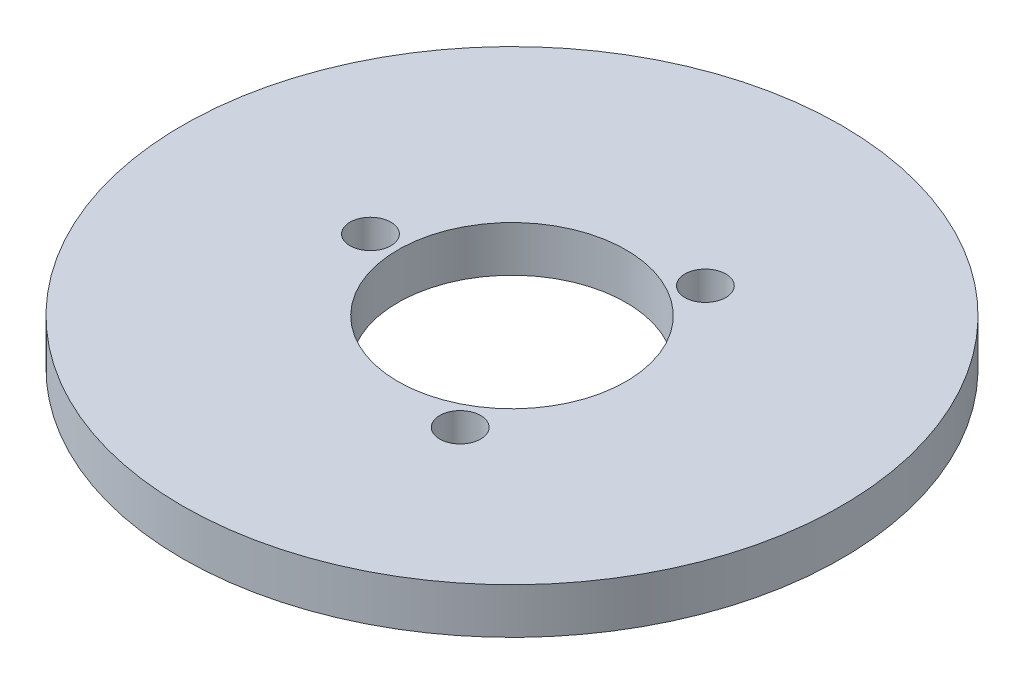
ISO-10303-21;
HEADER;
FILE_DESCRIPTION(('STEP AP214'),'2;1');
FILE_NAME('part.step','',(''),(''),'','','');
FILE_SCHEMA(('AUTOMOTIVE_DESIGN { 1 0 10303 214 1 1 1 1 }'));
ENDSEC;
DATA;
#1=APPLICATION_CONTEXT('core data for automotive mechanical design processes');
#2=APPLICATION_PROTOCOL_DEFINITION('international standard','automotive_design',2000,#1);
#3=PRODUCT_CONTEXT('',#1,'mechanical');
#4=PRODUCT('Part','Part','',(#3));
#5=PRODUCT_RELATED_PRODUCT_CATEGORY('part','',(#4));
#6=PRODUCT_DEFINITION_FORMATION('','',#4);
#7=PRODUCT_DEFINITION_CONTEXT('part definition',#1,'design');
#8=PRODUCT_DEFINITION('design','',#6,#7);
#9=PRODUCT_DEFINITION_SHAPE('','',#8);
#10=(LENGTH_UNIT() NAMED_UNIT(*) SI_UNIT(.MILLI.,.METRE.));
#11=(NAMED_UNIT(*) PLANE_ANGLE_UNIT() SI_UNIT($,.RADIAN.));
#12=(NAMED_UNIT(*) SI_UNIT($,.STERADIAN.) SOLID_ANGLE_UNIT());
#13=UNCERTAINTY_MEASURE_WITH_UNIT(LENGTH_MEASURE(1.E-05),#10,'distance_accuracy_value','');
#14=(GEOMETRIC_REPRESENTATION_CONTEXT(3) GLOBAL_UNCERTAINTY_ASSIGNED_CONTEXT((#13)) GLOBAL_UNIT_ASSIGNED_CONTEXT((#10,
#11,#12)) REPRESENTATION_CONTEXT('',''));
#15=CARTESIAN_POINT('',(0.,0.,0.));
#16=DIRECTION('',(0.,0.,1.));
#17=DIRECTION('',(1.,0.,0.));
#18=AXIS2_PLACEMENT_3D('',#15,#16,#17);
#19=CARTESIAN_POINT('',(0.,9.,0.));
#20=DIRECTION('',(0.,-1.,0.));
#21=DIRECTION('',(0.,0.,-1.));
#22=AXIS2_PLACEMENT_3D('',#19,#20,#21);
#23=CYLINDRICAL_SURFACE('',#22,65.);
#24=CARTESIAN_POINT('',(0.,9.,0.));
#25=DIRECTION('',(0.,1.,0.));
#26=DIRECTION('',(0.,0.,1.));
#27=AXIS2_PLACEMENT_3D('',#24,#25,#26);
#28=CIRCLE('',#27,65.);
#29=CARTESIAN_POINT('',(0.,9.,65.));
#30=VERTEX_POINT('',#29);
#31=EDGE_CURVE('E10',#30,#30,#28,.T.);
#32=ORIENTED_EDGE('',*,*,#31,.F.);
#33=EDGE_LOOP('',(#32));
#34=FACE_BOUND('',#33,.T.);
#35=CARTESIAN_POINT('',(0.,0.,0.));
#36=DIRECTION('',(0.,1.,0.));
#37=DIRECTION('',(0.,0.,1.));
#38=AXIS2_PLACEMENT_3D('',#35,#36,#37);
#39=CIRCLE('',#38,65.);
#40=CARTESIAN_POINT('',(0.,0.,65.));
#41=VERTEX_POINT('',#40);
#42=EDGE_CURVE('E37',#41,#41,#39,.T.);
#43=ORIENTED_EDGE('',*,*,#42,.T.);
#44=EDGE_LOOP('',(#43));
#45=FACE_BOUND('',#44,.T.);
#46=ADVANCED_FACE('F40',(#34,#45),#23,.T.);
#47=CARTESIAN_POINT('',(0.,9.,0.));
#48=DIRECTION('',(0.,1.,0.));
#49=DIRECTION('',(0.,0.,1.));
#50=AXIS2_PLACEMENT_3D('',#47,#48,#49);
#51=PLANE('',#50);
#52=CARTESIAN_POINT('',(13.9585248151331,9.,24.1768741785213));
#53=DIRECTION('',(0.,1.,0.));
#54=DIRECTION('',(0.866025403784436,0.,-0.500000000000004));
#55=AXIS2_PLACEMENT_3D('',#52,#53,#54);
#56=CIRCLE('',#55,4.03660627676734);
#57=CARTESIAN_POINT('',(17.4543283958894,9.,22.1585710401376));
#58=VERTEX_POINT('',#57);
#59=EDGE_CURVE('E70',#58,#58,#56,.T.);
#60=ORIENTED_EDGE('',*,*,#59,.F.);
#61=EDGE_LOOP('',(#60));
#62=FACE_BOUND('',#61,.T.);
#63=CARTESIAN_POINT('',(13.9585248151328,9.,-24.1768741785215));
#64=DIRECTION('',(0.,1.,0.));
#65=DIRECTION('',(-0.866025403784443,0.,-0.499999999999992));
#66=AXIS2_PLACEMENT_3D('',#63,#64,#65);
#67=CIRCLE('',#66,4.03660627676734);
#68=CARTESIAN_POINT('',(10.4627212343765,9.,-26.1951773169051));
#69=VERTEX_POINT('',#68);
#70=EDGE_CURVE('E61',#69,#69,#67,.T.);
#71=ORIENTED_EDGE('',*,*,#70,.F.);
#72=EDGE_LOOP('',(#71));
#73=FACE_BOUND('',#72,.T.);
#74=CARTESIAN_POINT('',(-27.9170496302661,9.,0.));
#75=DIRECTION('',(0.,1.,0.));
#76=DIRECTION('',(0.,0.,1.));
#77=AXIS2_PLACEMENT_3D('',#74,#75,#76);
#78=CIRCLE('',#77,4.03660627676734);
#79=CARTESIAN_POINT('',(-27.9170496302661,9.,4.03660627676734));
#80=VERTEX_POINT('',#79);
#81=EDGE_CURVE('E54',#80,#80,#78,.T.);
#82=ORIENTED_EDGE('',*,*,#81,.F.);
#83=EDGE_LOOP('',(#82));
#84=FACE_BOUND('',#83,.T.);
#85=CARTESIAN_POINT('',(0.,9.,0.));
#86=DIRECTION('',(0.,1.,0.));
#87=DIRECTION('',(0.,0.,1.));
#88=AXIS2_PLACEMENT_3D('',#85,#86,#87);
#89=CIRCLE('',#88,22.5);
#90=CARTESIAN_POINT('',(0.,9.,22.5));
#91=VERTEX_POINT('',#90);
#92=EDGE_CURVE('E50',#91,#91,#89,.T.);
#93=ORIENTED_EDGE('',*,*,#92,.F.);
#94=EDGE_LOOP('',(#93));
#95=FACE_BOUND('',#94,.T.);
#96=ORIENTED_EDGE('',*,*,#31,.T.);
#97=EDGE_LOOP('',(#96));
#98=FACE_BOUND('',#97,.T.);
#99=ADVANCED_FACE('F85',(#62,#73,#84,#95,#98),#51,.T.);
#100=CARTESIAN_POINT('',(0.,0.,0.));
#101=DIRECTION('',(0.,1.,0.));
#102=DIRECTION('',(0.,0.,1.));
#103=AXIS2_PLACEMENT_3D('',#100,#101,#102);
#104=PLANE('',#103);
#105=CARTESIAN_POINT('',(0.,0.,0.));
#106=DIRECTION('',(0.,1.,0.));
#107=DIRECTION('',(0.,0.,1.));
#108=AXIS2_PLACEMENT_3D('',#105,#106,#107);
#109=CIRCLE('',#108,22.5);
#110=CARTESIAN_POINT('',(0.,0.,22.5));
#111=VERTEX_POINT('',#110);
#112=EDGE_CURVE('E47',#111,#111,#109,.T.);
#113=ORIENTED_EDGE('',*,*,#112,.T.);
#114=EDGE_LOOP('',(#113));
#115=FACE_BOUND('',#114,.T.);
#116=ORIENTED_EDGE('',*,*,#42,.F.);
#117=EDGE_LOOP('',(#116));
#118=FACE_BOUND('',#117,.T.);
#119=ADVANCED_FACE('F84',(#115,#118),#104,.F.);
#120=CARTESIAN_POINT('',(0.,9.,0.));
#121=DIRECTION('',(0.,-1.,0.));
#122=DIRECTION('',(0.,0.,-1.));
#123=AXIS2_PLACEMENT_3D('',#120,#121,#122);
#124=CYLINDRICAL_SURFACE('',#123,22.5);
#125=ORIENTED_EDGE('',*,*,#92,.T.);
#126=EDGE_LOOP('',(#125));
#127=FACE_BOUND('',#126,.T.);
#128=ORIENTED_EDGE('',*,*,#112,.F.);
#129=EDGE_LOOP('',(#128));
#130=FACE_BOUND('',#129,.T.);
#131=ADVANCED_FACE('F91',(#127,#130),#124,.F.);
#132=CARTESIAN_POINT('',(-27.9170496302661,0.120147289122543,0.));
#133=DIRECTION('',(0.,1.,0.));
#134=DIRECTION('',(0.,0.,1.));
#135=AXIS2_PLACEMENT_3D('',#132,#133,#134);
#136=CYLINDRICAL_SURFACE('',#135,4.03660627676734);
#137=CARTESIAN_POINT('',(-27.9170496302661,0.120147289122543,0.));
#138=DIRECTION('',(0.,1.,0.));
#139=DIRECTION('',(0.,0.,1.));
#140=AXIS2_PLACEMENT_3D('',#137,#138,#139);
#141=CIRCLE('',#140,4.03660627676734);
#142=CARTESIAN_POINT('',(-27.9170496302661,0.120147289122543,4.03660627676734));
#143=VERTEX_POINT('',#142);
#144=EDGE_CURVE('E55',#143,#143,#141,.T.);
#145=ORIENTED_EDGE('',*,*,#144,.F.);
#146=EDGE_LOOP('',(#145));
#147=FACE_BOUND('',#146,.T.);
#148=ORIENTED_EDGE('',*,*,#81,.T.);
#149=EDGE_LOOP('',(#148));
#150=FACE_BOUND('',#149,.T.);
#151=ADVANCED_FACE('F96',(#147,#150),#136,.F.);
#152=CARTESIAN_POINT('',(-27.9170496302661,0.120147289122543,0.));
#153=DIRECTION('',(0.,1.,0.));
#154=DIRECTION('',(0.,0.,1.));
#155=AXIS2_PLACEMENT_3D('',#152,#153,#154);
#156=PLANE('',#155);
#157=ORIENTED_EDGE('',*,*,#144,.T.);
#158=EDGE_LOOP('',(#157));
#159=FACE_BOUND('',#158,.T.);
#160=ADVANCED_FACE('F127',(#159),#156,.T.);
#161=CARTESIAN_POINT('',(13.9585248151328,0.120147289122543,-24.1768741785215));
#162=DIRECTION('',(0.,1.,0.));
#163=DIRECTION('',(0.,0.,1.));
#164=AXIS2_PLACEMENT_3D('',#161,#162,#163);
#165=CYLINDRICAL_SURFACE('',#164,4.03660627676734);
#166=CARTESIAN_POINT('',(13.9585248151328,0.120147289122543,-24.1768741785215));
#167=DIRECTION('',(0.,1.,0.));
#168=DIRECTION('',(-0.866025403784443,0.,-0.499999999999992));
#169=AXIS2_PLACEMENT_3D('',#166,#167,#168);
#170=CIRCLE('',#169,4.03660627676734);
#171=CARTESIAN_POINT('',(10.4627212343765,0.120147289122543,-26.1951773169051));
#172=VERTEX_POINT('',#171);
#173=EDGE_CURVE('E63',#172,#172,#170,.T.);
#174=ORIENTED_EDGE('',*,*,#173,.F.);
#175=EDGE_LOOP('',(#174));
#176=FACE_BOUND('',#175,.T.);
#177=ORIENTED_EDGE('',*,*,#70,.T.);
#178=EDGE_LOOP('',(#177));
#179=FACE_BOUND('',#178,.T.);
#180=ADVANCED_FACE('F133',(#176,#179),#165,.F.);
#181=CARTESIAN_POINT('',(13.9585248151328,0.120147289122543,-24.1768741785215));
#182=DIRECTION('',(0.,1.,0.));
#183=DIRECTION('',(-0.866025403784443,0.,-0.499999999999992));
#184=AXIS2_PLACEMENT_3D('',#181,#182,#183);
#185=PLANE('',#184);
#186=ORIENTED_EDGE('',*,*,#173,.T.);
#187=EDGE_LOOP('',(#186));
#188=FACE_BOUND('',#187,.T.);
#189=ADVANCED_FACE('F77',(#188),#185,.T.);
#190=CARTESIAN_POINT('',(13.9585248151331,0.120147289122543,24.1768741785213));
#191=DIRECTION('',(0.,1.,0.));
#192=DIRECTION('',(0.,0.,1.));
#193=AXIS2_PLACEMENT_3D('',#190,#191,#192);
#194=CYLINDRICAL_SURFACE('',#193,4.03660627676734);
#195=CARTESIAN_POINT('',(13.9585248151331,0.120147289122543,24.1768741785213));
#196=DIRECTION('',(0.,1.,0.));
#197=DIRECTION('',(0.866025403784436,0.,-0.500000000000004));
#198=AXIS2_PLACEMENT_3D('',#195,#196,#197);
#199=CIRCLE('',#198,4.03660627676734);
#200=CARTESIAN_POINT('',(17.4543283958894,0.120147289122543,22.1585710401376));
#201=VERTEX_POINT('',#200);
#202=EDGE_CURVE('E59',#201,#201,#199,.T.);
#203=ORIENTED_EDGE('',*,*,#202,.F.);
#204=EDGE_LOOP('',(#203));
#205=FACE_BOUND('',#204,.T.);
#206=ORIENTED_EDGE('',*,*,#59,.T.);
#207=EDGE_LOOP('',(#206));
#208=FACE_BOUND('',#207,.T.);
#209=ADVANCED_FACE('F73',(#205,#208),#194,.F.);
#210=CARTESIAN_POINT('',(13.9585248151331,0.120147289122543,24.1768741785213));
#211=DIRECTION('',(0.,1.,0.));
#212=DIRECTION('',(0.866025403784436,0.,-0.500000000000004));
#213=AXIS2_PLACEMENT_3D('',#210,#211,#212);
#214=PLANE('',#213);
#215=ORIENTED_EDGE('',*,*,#202,.T.);
#216=EDGE_LOOP('',(#215));
#217=FACE_BOUND('',#216,.T.);
#218=ADVANCED_FACE('F71',(#217),#214,.T.);
#219=CLOSED_SHELL('',(#46,#99,#119,#131,#151,#160,#180,#189,#209,#218));
#220=MANIFOLD_SOLID_BREP('B2',#219);
#221=ADVANCED_BREP_SHAPE_REPRESENTATION('',(#18,#220),#14);
#222=SHAPE_DEFINITION_REPRESENTATION(#9,#221);
ENDSEC;
END-ISO-10303-21;
